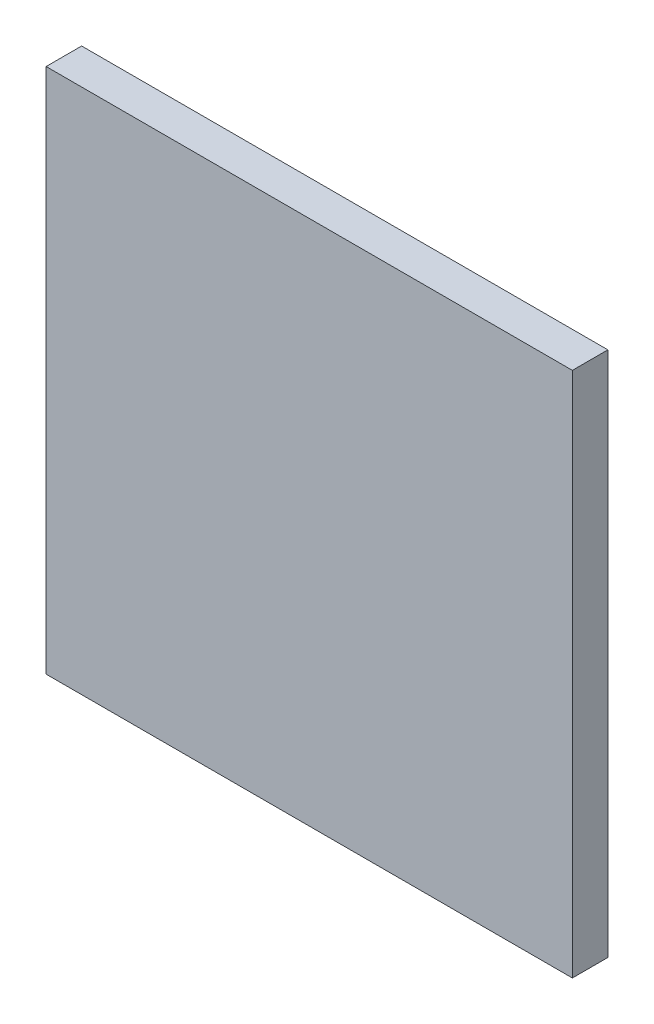
ISO-10303-21;
HEADER;
FILE_DESCRIPTION(('STEP AP214'),'2;1');
FILE_NAME('part.step','',(''),(''),'','','');
FILE_SCHEMA(('AUTOMOTIVE_DESIGN { 1 0 10303 214 1 1 1 1 }'));
ENDSEC;
DATA;
#1=APPLICATION_CONTEXT('core data for automotive mechanical design processes');
#2=APPLICATION_PROTOCOL_DEFINITION('international standard','automotive_design',2000,#1);
#3=PRODUCT_CONTEXT('',#1,'mechanical');
#4=PRODUCT('Part','Part','',(#3));
#5=PRODUCT_RELATED_PRODUCT_CATEGORY('part','',(#4));
#6=PRODUCT_DEFINITION_FORMATION('','',#4);
#7=PRODUCT_DEFINITION_CONTEXT('part definition',#1,'design');
#8=PRODUCT_DEFINITION('design','',#6,#7);
#9=PRODUCT_DEFINITION_SHAPE('','',#8);
#10=(LENGTH_UNIT() NAMED_UNIT(*) SI_UNIT(.MILLI.,.METRE.));
#11=(NAMED_UNIT(*) PLANE_ANGLE_UNIT() SI_UNIT($,.RADIAN.));
#12=(NAMED_UNIT(*) SI_UNIT($,.STERADIAN.) SOLID_ANGLE_UNIT());
#13=UNCERTAINTY_MEASURE_WITH_UNIT(LENGTH_MEASURE(1.E-05),#10,'distance_accuracy_value','');
#14=(GEOMETRIC_REPRESENTATION_CONTEXT(3) GLOBAL_UNCERTAINTY_ASSIGNED_CONTEXT((#13)) GLOBAL_UNIT_ASSIGNED_CONTEXT((#10,
#11,#12)) REPRESENTATION_CONTEXT('',''));
#15=CARTESIAN_POINT('',(0.,0.,0.));
#16=DIRECTION('',(0.,0.,1.));
#17=DIRECTION('',(1.,0.,0.));
#18=AXIS2_PLACEMENT_3D('',#15,#16,#17);
#19=CARTESIAN_POINT('',(2.5781,9.458706,0.76487));
#20=DIRECTION('',(0.,0.,-1.));
#21=DIRECTION('',(0.,1.,0.));
#22=AXIS2_PLACEMENT_3D('',#19,#20,#21);
#23=PLANE('',#22);
#24=DIRECTION('',(1.,0.,0.));
#25=VECTOR('',#24,1.);
#26=CARTESIAN_POINT('',(2.3241,9.712706,0.76487));
#27=LINE('',#26,#25);
#28=CARTESIAN_POINT('',(2.3241,9.712706,0.76487));
#29=VERTEX_POINT('',#28);
#30=CARTESIAN_POINT('',(2.8321,9.712706,0.76487));
#31=VERTEX_POINT('',#30);
#32=EDGE_CURVE('E55',#29,#31,#27,.T.);
#33=ORIENTED_EDGE('',*,*,#32,.T.);
#34=DIRECTION('',(0.,1.,0.));
#35=VECTOR('',#34,1.);
#36=CARTESIAN_POINT('',(2.8321,9.712706,0.76487));
#37=LINE('',#36,#35);
#38=CARTESIAN_POINT('',(2.8321,9.204706,0.76487));
#39=VERTEX_POINT('',#38);
#40=EDGE_CURVE('E57',#31,#39,#37,.F.);
#41=ORIENTED_EDGE('',*,*,#40,.T.);
#42=DIRECTION('',(1.,0.,0.));
#43=VECTOR('',#42,1.);
#44=CARTESIAN_POINT('',(2.8321,9.204706,0.76487));
#45=LINE('',#44,#43);
#46=CARTESIAN_POINT('',(2.3241,9.204706,0.76487));
#47=VERTEX_POINT('',#46);
#48=EDGE_CURVE('E20',#39,#47,#45,.F.);
#49=ORIENTED_EDGE('',*,*,#48,.T.);
#50=DIRECTION('',(0.,1.,0.));
#51=VECTOR('',#50,1.);
#52=CARTESIAN_POINT('',(2.3241,9.204706,0.76487));
#53=LINE('',#52,#51);
#54=EDGE_CURVE('E80',#47,#29,#53,.T.);
#55=ORIENTED_EDGE('',*,*,#54,.T.);
#56=EDGE_LOOP('',(#33,#41,#49,#55));
#57=FACE_BOUND('',#56,.T.);
#58=ADVANCED_FACE('F17',(#57),#23,.T.);
#59=CARTESIAN_POINT('',(2.8321,9.204706,0.76487));
#60=DIRECTION('',(0.,1.,0.));
#61=DIRECTION('',(0.,0.,1.));
#62=AXIS2_PLACEMENT_3D('',#59,#60,#61);
#63=PLANE('',#62);
#64=DIRECTION('',(0.,0.,1.));
#65=VECTOR('',#64,1.);
#66=CARTESIAN_POINT('',(2.3241,9.204706,0.76487));
#67=LINE('',#66,#65);
#68=CARTESIAN_POINT('',(2.3241,9.204706,0.79916));
#69=VERTEX_POINT('',#68);
#70=EDGE_CURVE('E68',#69,#47,#67,.F.);
#71=ORIENTED_EDGE('',*,*,#70,.T.);
#72=ORIENTED_EDGE('',*,*,#48,.F.);
#73=DIRECTION('',(0.,0.,1.));
#74=VECTOR('',#73,1.);
#75=CARTESIAN_POINT('',(2.8321,9.204706,0.76487));
#76=LINE('',#75,#74);
#77=CARTESIAN_POINT('',(2.8321,9.204706,0.79916));
#78=VERTEX_POINT('',#77);
#79=EDGE_CURVE('E63',#39,#78,#76,.T.);
#80=ORIENTED_EDGE('',*,*,#79,.T.);
#81=DIRECTION('',(1.,0.,0.));
#82=VECTOR('',#81,1.);
#83=CARTESIAN_POINT('',(2.5781,9.204706,0.79916));
#84=LINE('',#83,#82);
#85=EDGE_CURVE('E83',#69,#78,#84,.T.);
#86=ORIENTED_EDGE('',*,*,#85,.F.);
#87=EDGE_LOOP('',(#71,#72,#80,#86));
#88=FACE_BOUND('',#87,.T.);
#89=ADVANCED_FACE('F65',(#88),#63,.F.);
#90=CARTESIAN_POINT('',(2.8321,9.712706,0.76487));
#91=DIRECTION('',(-1.,0.,0.));
#92=DIRECTION('',(0.,0.,1.));
#93=AXIS2_PLACEMENT_3D('',#90,#91,#92);
#94=PLANE('',#93);
#95=ORIENTED_EDGE('',*,*,#79,.F.);
#96=ORIENTED_EDGE('',*,*,#40,.F.);
#97=DIRECTION('',(0.,0.,-1.));
#98=VECTOR('',#97,1.);
#99=CARTESIAN_POINT('',(2.8321,9.712706,0.76487));
#100=LINE('',#99,#98);
#101=CARTESIAN_POINT('',(2.8321,9.712706,0.79916));
#102=VERTEX_POINT('',#101);
#103=EDGE_CURVE('E75',#31,#102,#100,.F.);
#104=ORIENTED_EDGE('',*,*,#103,.T.);
#105=DIRECTION('',(0.,-1.,0.));
#106=VECTOR('',#105,1.);
#107=CARTESIAN_POINT('',(2.8321,9.458706,0.79916));
#108=LINE('',#107,#106);
#109=EDGE_CURVE('E72',#78,#102,#108,.F.);
#110=ORIENTED_EDGE('',*,*,#109,.F.);
#111=EDGE_LOOP('',(#95,#96,#104,#110));
#112=FACE_BOUND('',#111,.T.);
#113=ADVANCED_FACE('F70',(#112),#94,.F.);
#114=CARTESIAN_POINT('',(2.3241,9.712706,0.76487));
#115=DIRECTION('',(0.,-1.,0.));
#116=DIRECTION('',(0.,0.,-1.));
#117=AXIS2_PLACEMENT_3D('',#114,#115,#116);
#118=PLANE('',#117);
#119=ORIENTED_EDGE('',*,*,#103,.F.);
#120=ORIENTED_EDGE('',*,*,#32,.F.);
#121=DIRECTION('',(0.,0.,1.));
#122=VECTOR('',#121,1.);
#123=CARTESIAN_POINT('',(2.3241,9.712706,0.76487));
#124=LINE('',#123,#122);
#125=CARTESIAN_POINT('',(2.3241,9.712706,0.79916));
#126=VERTEX_POINT('',#125);
#127=EDGE_CURVE('E35',#29,#126,#124,.T.);
#128=ORIENTED_EDGE('',*,*,#127,.T.);
#129=DIRECTION('',(1.,0.,0.));
#130=VECTOR('',#129,1.);
#131=CARTESIAN_POINT('',(2.5781,9.712706,0.79916));
#132=LINE('',#131,#130);
#133=EDGE_CURVE('E26',#102,#126,#132,.F.);
#134=ORIENTED_EDGE('',*,*,#133,.F.);
#135=EDGE_LOOP('',(#119,#120,#128,#134));
#136=FACE_BOUND('',#135,.T.);
#137=ADVANCED_FACE('F89',(#136),#118,.F.);
#138=CARTESIAN_POINT('',(2.3241,9.204706,0.76487));
#139=DIRECTION('',(1.,0.,0.));
#140=DIRECTION('',(0.,1.,0.));
#141=AXIS2_PLACEMENT_3D('',#138,#139,#140);
#142=PLANE('',#141);
#143=ORIENTED_EDGE('',*,*,#127,.F.);
#144=ORIENTED_EDGE('',*,*,#54,.F.);
#145=ORIENTED_EDGE('',*,*,#70,.F.);
#146=DIRECTION('',(0.,-1.,0.));
#147=VECTOR('',#146,1.);
#148=CARTESIAN_POINT('',(2.3241,9.458706,0.79916));
#149=LINE('',#148,#147);
#150=EDGE_CURVE('E11',#126,#69,#149,.T.);
#151=ORIENTED_EDGE('',*,*,#150,.F.);
#152=EDGE_LOOP('',(#143,#144,#145,#151));
#153=FACE_BOUND('',#152,.T.);
#154=ADVANCED_FACE('F91',(#153),#142,.F.);
#155=CARTESIAN_POINT('',(2.5781,9.458706,0.79916));
#156=DIRECTION('',(0.,0.,1.));
#157=DIRECTION('',(0.,-1.,0.));
#158=AXIS2_PLACEMENT_3D('',#155,#156,#157);
#159=PLANE('',#158);
#160=ORIENTED_EDGE('',*,*,#133,.T.);
#161=ORIENTED_EDGE('',*,*,#150,.T.);
#162=ORIENTED_EDGE('',*,*,#85,.T.);
#163=ORIENTED_EDGE('',*,*,#109,.T.);
#164=EDGE_LOOP('',(#160,#161,#162,#163));
#165=FACE_BOUND('',#164,.T.);
#166=ADVANCED_FACE('F88',(#165),#159,.T.);
#167=CLOSED_SHELL('',(#58,#89,#113,#137,#154,#166));
#168=MANIFOLD_SOLID_BREP('B1',#167);
#169=ADVANCED_BREP_SHAPE_REPRESENTATION('',(#18,#168),#14);
#170=SHAPE_DEFINITION_REPRESENTATION(#9,#169);
ENDSEC;
END-ISO-10303-21;
